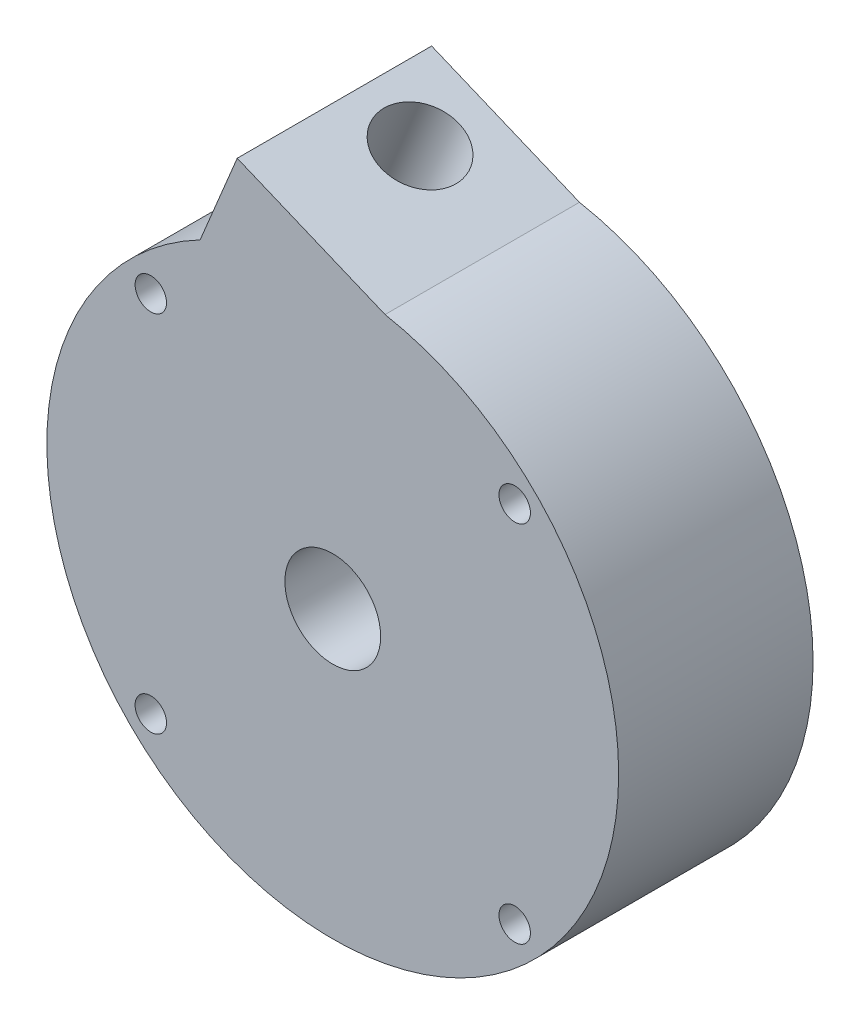
ISO-10303-21;
HEADER;
FILE_DESCRIPTION(('STEP AP214'),'2;1');
FILE_NAME('part.step','',(''),(''),'','','');
FILE_SCHEMA(('AUTOMOTIVE_DESIGN { 1 0 10303 214 1 1 1 1 }'));
ENDSEC;
DATA;
#1=APPLICATION_CONTEXT('core data for automotive mechanical design processes');
#2=APPLICATION_PROTOCOL_DEFINITION('international standard','automotive_design',2000,#1);
#3=PRODUCT_CONTEXT('',#1,'mechanical');
#4=PRODUCT('Part','Part','',(#3));
#5=PRODUCT_RELATED_PRODUCT_CATEGORY('part','',(#4));
#6=PRODUCT_DEFINITION_FORMATION('','',#4);
#7=PRODUCT_DEFINITION_CONTEXT('part definition',#1,'design');
#8=PRODUCT_DEFINITION('design','',#6,#7);
#9=PRODUCT_DEFINITION_SHAPE('','',#8);
#10=(LENGTH_UNIT() NAMED_UNIT(*) SI_UNIT(.MILLI.,.METRE.));
#11=(NAMED_UNIT(*) PLANE_ANGLE_UNIT() SI_UNIT($,.RADIAN.));
#12=(NAMED_UNIT(*) SI_UNIT($,.STERADIAN.) SOLID_ANGLE_UNIT());
#13=UNCERTAINTY_MEASURE_WITH_UNIT(LENGTH_MEASURE(1.E-05),#10,'distance_accuracy_value','');
#14=(GEOMETRIC_REPRESENTATION_CONTEXT(3) GLOBAL_UNCERTAINTY_ASSIGNED_CONTEXT((#13)) GLOBAL_UNIT_ASSIGNED_CONTEXT((#10,
#11,#12)) REPRESENTATION_CONTEXT('',''));
#15=CARTESIAN_POINT('',(0.,0.,0.));
#16=DIRECTION('',(0.,0.,1.));
#17=DIRECTION('',(1.,0.,0.));
#18=AXIS2_PLACEMENT_3D('',#15,#16,#17);
#19=CARTESIAN_POINT('',(0.,0.,34.));
#20=DIRECTION('',(0.,0.,1.));
#21=DIRECTION('',(1.,0.,0.));
#22=AXIS2_PLACEMENT_3D('',#19,#20,#21);
#23=PLANE('',#22);
#24=CARTESIAN_POINT('',(0.,0.,34.));
#25=DIRECTION('',(0.,0.,1.));
#26=DIRECTION('',(1.,0.,0.));
#27=AXIS2_PLACEMENT_3D('',#24,#25,#26);
#28=CIRCLE('',#27,8.37499999999999);
#29=CARTESIAN_POINT('',(8.37499999999999,0.,34.));
#30=VERTEX_POINT('',#29);
#31=EDGE_CURVE('E320',#30,#30,#28,.T.);
#32=ORIENTED_EDGE('',*,*,#31,.F.);
#33=EDGE_LOOP('',(#32));
#34=FACE_BOUND('',#33,.T.);
#35=CARTESIAN_POINT('',(0.,0.,34.));
#36=DIRECTION('',(0.,0.,1.));
#37=DIRECTION('',(1.,0.,0.));
#38=AXIS2_PLACEMENT_3D('',#35,#36,#37);
#39=CIRCLE('',#38,50.);
#40=CARTESIAN_POINT('',(-23.1916722818952,44.2961210126708,34.));
#41=VERTEX_POINT('',#40);
#42=CARTESIAN_POINT('',(9.14885542392408,49.1558586989602,34.));
#43=VERTEX_POINT('',#42);
#44=EDGE_CURVE('E12',#41,#43,#39,.T.);
#45=ORIENTED_EDGE('',*,*,#44,.T.);
#46=DIRECTION('',(-0.923448007913106,0.383723568055595,0.));
#47=VECTOR('',#46,1.);
#48=CARTESIAN_POINT('',(57.7939064023322,28.9422111847218,34.));
#49=LINE('',#48,#47);
#50=CARTESIAN_POINT('',(-16.707688797643,59.9001186045169,34.));
#51=VERTEX_POINT('',#50);
#52=EDGE_CURVE('E115',#43,#51,#49,.T.);
#53=ORIENTED_EDGE('',*,*,#52,.T.);
#54=DIRECTION('',(0.383723568055596,0.923448007913105,0.));
#55=VECTOR('',#54,1.);
#56=CARTESIAN_POINT('',(-74.5015951999753,-79.1835139364422,34.));
#57=LINE('',#56,#55);
#58=EDGE_CURVE('E65',#41,#51,#57,.T.);
#59=ORIENTED_EDGE('',*,*,#58,.F.);
#60=EDGE_LOOP('',(#45,#53,#59));
#61=FACE_BOUND('',#60,.T.);
#62=CARTESIAN_POINT('',(31.8198051533946,-31.8198051533946,34.));
#63=DIRECTION('',(0.,0.,1.));
#64=DIRECTION('',(1.,0.,0.));
#65=AXIS2_PLACEMENT_3D('',#62,#63,#64);
#66=CIRCLE('',#65,2.74999999999999);
#67=CARTESIAN_POINT('',(34.5698051533946,-31.8198051533946,34.));
#68=VERTEX_POINT('',#67);
#69=EDGE_CURVE('E139',#68,#68,#66,.T.);
#70=ORIENTED_EDGE('',*,*,#69,.F.);
#71=EDGE_LOOP('',(#70));
#72=FACE_BOUND('',#71,.T.);
#73=CARTESIAN_POINT('',(-31.8198051533946,31.8198051533946,34.));
#74=DIRECTION('',(0.,0.,1.));
#75=DIRECTION('',(1.,0.,0.));
#76=AXIS2_PLACEMENT_3D('',#73,#74,#75);
#77=CIRCLE('',#76,2.74999999999999);
#78=CARTESIAN_POINT('',(-29.0698051533946,31.8198051533946,34.));
#79=VERTEX_POINT('',#78);
#80=EDGE_CURVE('E143',#79,#79,#77,.T.);
#81=ORIENTED_EDGE('',*,*,#80,.F.);
#82=EDGE_LOOP('',(#81));
#83=FACE_BOUND('',#82,.T.);
#84=CARTESIAN_POINT('',(-31.8198051533946,-31.8198051533946,34.));
#85=DIRECTION('',(0.,0.,1.));
#86=DIRECTION('',(1.,0.,0.));
#87=AXIS2_PLACEMENT_3D('',#84,#85,#86);
#88=CIRCLE('',#87,2.74999999999999);
#89=CARTESIAN_POINT('',(-29.0698051533946,-31.8198051533946,34.));
#90=VERTEX_POINT('',#89);
#91=EDGE_CURVE('E147',#90,#90,#88,.T.);
#92=ORIENTED_EDGE('',*,*,#91,.F.);
#93=EDGE_LOOP('',(#92));
#94=FACE_BOUND('',#93,.T.);
#95=CARTESIAN_POINT('',(31.8198051533946,31.8198051533946,34.));
#96=DIRECTION('',(0.,0.,1.));
#97=DIRECTION('',(1.,0.,0.));
#98=AXIS2_PLACEMENT_3D('',#95,#96,#97);
#99=CIRCLE('',#98,2.74999999999999);
#100=CARTESIAN_POINT('',(34.5698051533946,31.8198051533946,34.));
#101=VERTEX_POINT('',#100);
#102=EDGE_CURVE('E150',#101,#101,#99,.T.);
#103=ORIENTED_EDGE('',*,*,#102,.F.);
#104=EDGE_LOOP('',(#103));
#105=FACE_BOUND('',#104,.T.);
#106=ADVANCED_FACE('F50',(#34,#61,#72,#83,#94,#105),#23,.T.);
#107=CARTESIAN_POINT('',(0.,0.,0.));
#108=DIRECTION('',(0.,0.,1.));
#109=DIRECTION('',(1.,0.,0.));
#110=AXIS2_PLACEMENT_3D('',#107,#108,#109);
#111=PLANE('',#110);
#112=DIRECTION('',(0.923448007913106,-0.383723568055595,0.));
#113=VECTOR('',#112,1.);
#114=CARTESIAN_POINT('',(51.3099229180801,13.3382135928758,0.));
#115=LINE('',#114,#113);
#116=CARTESIAN_POINT('',(-20.4213282581558,43.144950308504,0.));
#117=VERTEX_POINT('',#116);
#118=CARTESIAN_POINT('',(-6.01553933471138,37.1588626468367,0.));
#119=VERTEX_POINT('',#118);
#120=EDGE_CURVE('E339',#117,#119,#115,.T.);
#121=ORIENTED_EDGE('',*,*,#120,.F.);
#122=DIRECTION('',(0.383723568055596,0.923448007913105,0.));
#123=VECTOR('',#122,1.);
#124=CARTESIAN_POINT('',(-71.7312511762359,-80.334684640609,0.));
#125=LINE('',#124,#123);
#126=CARTESIAN_POINT('',(-27.2378809360153,26.7406100093122,0.));
#127=VERTEX_POINT('',#126);
#128=EDGE_CURVE('E342',#127,#117,#125,.T.);
#129=ORIENTED_EDGE('',*,*,#128,.F.);
#130=CARTESIAN_POINT('',(-54.9413211734085,38.25231705098,0.));
#131=DIRECTION('',(0.,0.,1.));
#132=DIRECTION('',(1.,0.,0.));
#133=AXIS2_PLACEMENT_3D('',#130,#131,#132);
#134=CIRCLE('',#133,30.);
#135=CARTESIAN_POINT('',(-30.1189720521702,21.4044393180619,0.));
#136=VERTEX_POINT('',#135);
#137=EDGE_CURVE('E345',#136,#127,#134,.T.);
#138=ORIENTED_EDGE('',*,*,#137,.F.);
#139=CARTESIAN_POINT('',(-8.41161896583205,31.3925893543947,0.));
#140=CARTESIAN_POINT('',(-6.59498655692887,31.9273439059173,0.));
#141=CARTESIAN_POINT('',(-4.72759665589687,32.3040116625754,0.));
#142=CARTESIAN_POINT('',(-0.947579393855885,32.7269500427533,0.));
#143=CARTESIAN_POINT('',(0.964989800608965,32.7732083727551,0.));
#144=CARTESIAN_POINT('',(4.77710877725085,32.5310810574549,0.));
#145=CARTESIAN_POINT('',(6.6765988909068,32.2426934409023,0.));
#146=CARTESIAN_POINT('',(10.4042078217419,31.337263885961,0.));
#147=CARTESIAN_POINT('',(12.2322672936029,30.7202304457304,0.));
#148=CARTESIAN_POINT('',(15.760360447992,29.173637757705,0.));
#149=CARTESIAN_POINT('',(17.4603369387661,28.2440973030589,0.));
#150=CARTESIAN_POINT('',(20.6790622470469,26.098347596263,0.));
#151=CARTESIAN_POINT('',(22.1977578054618,24.8821669390156,0.));
#152=CARTESIAN_POINT('',(25.0058356427531,22.198009272827,0.));
#153=CARTESIAN_POINT('',(26.2951702677157,20.7300698610981,0.));
#154=CARTESIAN_POINT('',(28.6030770399887,17.5852862615814,0.));
#155=CARTESIAN_POINT('',(29.621608652021,15.9084875898363,0.));
#156=CARTESIAN_POINT('',(31.3544252087226,12.3956449637935,0.));
#157=CARTESIAN_POINT('',(32.0686780431636,10.5596531079759,0.));
#158=CARTESIAN_POINT('',(33.1685124520496,6.78338183568033,0.));
#159=CARTESIAN_POINT('',(33.554071398709,4.84315954999618,0.));
#160=CARTESIAN_POINT('',(33.9819779982146,0.9170386600299,0.));
#161=CARTESIAN_POINT('',(34.0243132794646,-1.06879949890293,0.));
#162=CARTESIAN_POINT('',(33.7616448126502,-5.02565789488448,0.));
#163=CARTESIAN_POINT('',(33.4566394131377,-6.99661620578227,0.));
#164=CARTESIAN_POINT('',(32.5057860053459,-10.8631805220921,0.));
#165=CARTESIAN_POINT('',(31.8599472031514,-12.7587250146704,0.));
#166=CARTESIAN_POINT('',(30.2444344658908,-16.4157462169828,0.));
#167=CARTESIAN_POINT('',(29.274780398416,-18.1771637237506,0.));
#168=CARTESIAN_POINT('',(27.0387184652918,-21.5108525379583,0.));
#169=CARTESIAN_POINT('',(25.772340602703,-23.0830687928153,0.));
#170=CARTESIAN_POINT('',(22.9792358346881,-25.9886347223964,0.));
#171=CARTESIAN_POINT('',(21.4525482253563,-27.3219352222074,0.));
#172=CARTESIAN_POINT('',(18.1835090503277,-29.7068773521282,0.));
#173=CARTESIAN_POINT('',(16.4412049384089,-30.7584772449035,0.));
#174=CARTESIAN_POINT('',(12.7925922031796,-32.5455235820591,0.));
#175=CARTESIAN_POINT('',(10.8863377957731,-33.2809370698108,0.));
#176=CARTESIAN_POINT('',(6.96692751775982,-34.4105391787325,0.));
#177=CARTESIAN_POINT('',(4.95383101040614,-34.8047047072262,0.));
#178=CARTESIAN_POINT('',(0.881572969327515,-35.2370073616113,0.));
#179=CARTESIAN_POINT('',(-1.17752583972078,-35.2751320467303,0.));
#180=CARTESIAN_POINT('',(-5.27905712721527,-34.9913531552568,0.));
#181=CARTESIAN_POINT('',(-7.3214254229152,-34.669448255876,0.));
#182=CARTESIAN_POINT('',(-11.3267805742622,-33.6726219752596,0.));
#183=CARTESIAN_POINT('',(-13.2897037521198,-32.9977105165779,0.));
#184=CARTESIAN_POINT('',(-17.0753954472404,-31.3127657075608,0.));
#185=CARTESIAN_POINT('',(-18.898102754332,-30.3027533072263,0.));
#186=CARTESIAN_POINT('',(-22.3464123691171,-27.9759197387277,0.));
#187=CARTESIAN_POINT('',(-23.9719578360684,-26.6591299889305,0.));
#188=CARTESIAN_POINT('',(-26.9745944537781,-23.7566853350126,0.));
#189=CARTESIAN_POINT('',(-28.3516349151178,-22.1710714319796,0.));
#190=CARTESIAN_POINT('',(-30.8131330293807,-18.7774625019632,0.));
#191=CARTESIAN_POINT('',(-31.897547750371,-16.9695168713819,0.));
#192=CARTESIAN_POINT('',(-33.7382971452239,-13.1849080344906,0.));
#193=CARTESIAN_POINT('',(-34.4945980242525,-11.2083011650251,0.));
#194=CARTESIAN_POINT('',(-35.653409824858,-7.14562096872495,0.));
#195=CARTESIAN_POINT('',(-36.0558971975498,-5.05960923964018,0.));
#196=CARTESIAN_POINT('',(-36.492023630975,-0.841182207962756,0.));
#197=CARTESIAN_POINT('',(-36.5256501906637,1.2911680901299,0.));
#198=CARTESIAN_POINT('',(-36.2201917845468,5.5373040638973,0.));
#199=CARTESIAN_POINT('',(-35.8811058334673,7.65102330129104,0.));
#200=CARTESIAN_POINT('',(-34.8377581321816,11.7950031172486,0.));
#201=CARTESIAN_POINT('',(-34.1335070295338,13.8251978556522,0.));
#202=CARTESIAN_POINT('',(-32.3786188729451,17.739300975288,0.));
#203=CARTESIAN_POINT('',(-31.32800385937,19.6231461431737,0.));
#204=CARTESIAN_POINT('',(-30.1189720521702,21.4044393180619,0.));
#205=B_SPLINE_CURVE_WITH_KNOTS('',3,(#139,#140,#141,#142,#143,#144,#145,#146,#147,#148,#149,
#150,#151,#152,#153,#154,#155,#156,#157,#158,#159,#160,#161,#162,#163,#164,#165,#166,#167,#168,
#169,#170,#171,#172,#173,#174,#175,#176,#177,#178,#179,#180,#181,#182,#183,#184,#185,#186,#187,
#188,#189,#190,#191,#192,#193,#194,#195,#196,#197,#198,#199,#200,#201,#202,#203,#204),
.UNSPECIFIED.,.F.,.F.,(4,2,2,2,2,2,2,2,2,2,2,2,2,2,2,2,2,2,2,2,2,2,2,2,2,2,2,2,2,2,2,2,4),(0.,
0.03125,0.0625,0.09375,0.125,0.15625,0.1875,0.21875,0.25,0.28125,0.3125,0.34375,0.375,0.40625,
0.4375,0.46875,0.5,0.53125,0.5625,0.59375,0.625,0.65625,0.6875,0.71875,0.75,0.78125,0.8125,
0.84375,0.875,0.90625,0.9375,0.96875,1.),.UNSPECIFIED.);
#206=CARTESIAN_POINT('',(-8.41161896583204,31.3925893543947,0.));
#207=VERTEX_POINT('',#206);
#208=EDGE_CURVE('E73',#207,#136,#205,.T.);
#209=ORIENTED_EDGE('',*,*,#208,.F.);
#210=DIRECTION('',(0.383723568055595,0.923448007913106,0.));
#211=VECTOR('',#210,1.);
#212=CARTESIAN_POINT('',(-57.3254622527914,-86.3207723022763,0.));
#213=LINE('',#212,#211);
#214=EDGE_CURVE('E333',#207,#119,#213,.T.);
#215=ORIENTED_EDGE('',*,*,#214,.T.);
#216=EDGE_LOOP('',(#121,#129,#138,#209,#215));
#217=FACE_BOUND('',#216,.T.);
#218=CARTESIAN_POINT('',(31.8198051533946,-31.8198051533946,0.));
#219=DIRECTION('',(0.,0.,1.));
#220=DIRECTION('',(1.,0.,0.));
#221=AXIS2_PLACEMENT_3D('',#218,#219,#220);
#222=CIRCLE('',#221,2.74999999999999);
#223=CARTESIAN_POINT('',(34.5698051533946,-31.8198051533946,0.));
#224=VERTEX_POINT('',#223);
#225=EDGE_CURVE('E152',#224,#224,#222,.T.);
#226=ORIENTED_EDGE('',*,*,#225,.T.);
#227=EDGE_LOOP('',(#226));
#228=FACE_BOUND('',#227,.T.);
#229=CARTESIAN_POINT('',(-31.8198051533946,31.8198051533946,0.));
#230=DIRECTION('',(0.,0.,1.));
#231=DIRECTION('',(1.,0.,0.));
#232=AXIS2_PLACEMENT_3D('',#229,#230,#231);
#233=CIRCLE('',#232,2.74999999999999);
#234=CARTESIAN_POINT('',(-29.0698051533946,31.8198051533946,0.));
#235=VERTEX_POINT('',#234);
#236=EDGE_CURVE('E167',#235,#235,#233,.T.);
#237=ORIENTED_EDGE('',*,*,#236,.T.);
#238=EDGE_LOOP('',(#237));
#239=FACE_BOUND('',#238,.T.);
#240=CARTESIAN_POINT('',(0.,0.,0.));
#241=DIRECTION('',(0.,0.,1.));
#242=DIRECTION('',(1.,0.,0.));
#243=AXIS2_PLACEMENT_3D('',#240,#241,#242);
#244=CIRCLE('',#243,50.);
#245=CARTESIAN_POINT('',(-23.1916722818952,44.2961210126708,0.));
#246=VERTEX_POINT('',#245);
#247=CARTESIAN_POINT('',(9.14885542392408,49.1558586989602,0.));
#248=VERTEX_POINT('',#247);
#249=EDGE_CURVE('E59',#246,#248,#244,.T.);
#250=ORIENTED_EDGE('',*,*,#249,.F.);
#251=DIRECTION('',(0.383723568055596,0.923448007913106,0.));
#252=VECTOR('',#251,1.);
#253=CARTESIAN_POINT('',(-74.5015951999753,-79.1835139364422,0.));
#254=LINE('',#253,#252);
#255=CARTESIAN_POINT('',(-16.707688797643,59.9001186045169,0.));
#256=VERTEX_POINT('',#255);
#257=EDGE_CURVE('E122',#246,#256,#254,.T.);
#258=ORIENTED_EDGE('',*,*,#257,.T.);
#259=DIRECTION('',(-0.923448007913106,0.383723568055595,0.));
#260=VECTOR('',#259,1.);
#261=CARTESIAN_POINT('',(57.7939064023322,28.9422111847218,0.));
#262=LINE('',#261,#260);
#263=EDGE_CURVE('E129',#248,#256,#262,.T.);
#264=ORIENTED_EDGE('',*,*,#263,.F.);
#265=EDGE_LOOP('',(#250,#258,#264));
#266=FACE_BOUND('',#265,.T.);
#267=CARTESIAN_POINT('',(-31.8198051533946,-31.8198051533946,0.));
#268=DIRECTION('',(0.,0.,1.));
#269=DIRECTION('',(1.,0.,0.));
#270=AXIS2_PLACEMENT_3D('',#267,#268,#269);
#271=CIRCLE('',#270,2.74999999999999);
#272=CARTESIAN_POINT('',(-29.0698051533946,-31.8198051533946,0.));
#273=VERTEX_POINT('',#272);
#274=EDGE_CURVE('E163',#273,#273,#271,.T.);
#275=ORIENTED_EDGE('',*,*,#274,.T.);
#276=EDGE_LOOP('',(#275));
#277=FACE_BOUND('',#276,.T.);
#278=CARTESIAN_POINT('',(31.8198051533946,31.8198051533946,0.));
#279=DIRECTION('',(0.,0.,1.));
#280=DIRECTION('',(1.,0.,0.));
#281=AXIS2_PLACEMENT_3D('',#278,#279,#280);
#282=CIRCLE('',#281,2.74999999999999);
#283=CARTESIAN_POINT('',(34.5698051533946,31.8198051533946,0.));
#284=VERTEX_POINT('',#283);
#285=EDGE_CURVE('E153',#284,#284,#282,.T.);
#286=ORIENTED_EDGE('',*,*,#285,.T.);
#287=EDGE_LOOP('',(#286));
#288=FACE_BOUND('',#287,.T.);
#289=ADVANCED_FACE('F134',(#217,#228,#239,#266,#277,#288),#111,.F.);
#290=CARTESIAN_POINT('',(0.,0.,34.));
#291=DIRECTION('',(0.,0.,-1.));
#292=DIRECTION('',(-1.,0.,0.));
#293=AXIS2_PLACEMENT_3D('',#290,#291,#292);
#294=CYLINDRICAL_SURFACE('',#293,50.);
#295=ORIENTED_EDGE('',*,*,#44,.F.);
#296=DIRECTION('',(0.,0.,-1.));
#297=VECTOR('',#296,1.);
#298=CARTESIAN_POINT('',(-23.1916722818952,44.2961210126708,73.5357364269794));
#299=LINE('',#298,#297);
#300=EDGE_CURVE('E130',#41,#246,#299,.T.);
#301=ORIENTED_EDGE('',*,*,#300,.T.);
#302=ORIENTED_EDGE('',*,*,#249,.T.);
#303=DIRECTION('',(0.,0.,-1.));
#304=VECTOR('',#303,1.);
#305=CARTESIAN_POINT('',(9.14885542392408,49.1558586989602,73.5357364269794));
#306=LINE('',#305,#304);
#307=EDGE_CURVE('E119',#43,#248,#306,.T.);
#308=ORIENTED_EDGE('',*,*,#307,.F.);
#309=EDGE_LOOP('',(#295,#301,#302,#308));
#310=FACE_BOUND('',#309,.T.);
#311=ADVANCED_FACE('F52',(#310),#294,.T.);
#312=CARTESIAN_POINT('',(-31.8198051533946,31.8198051533946,34.));
#313=DIRECTION('',(0.,0.,-1.));
#314=DIRECTION('',(-1.,0.,0.));
#315=AXIS2_PLACEMENT_3D('',#312,#313,#314);
#316=CYLINDRICAL_SURFACE('',#315,2.74999999999999);
#317=ORIENTED_EDGE('',*,*,#80,.T.);
#318=EDGE_LOOP('',(#317));
#319=FACE_BOUND('',#318,.T.);
#320=ORIENTED_EDGE('',*,*,#236,.F.);
#321=EDGE_LOOP('',(#320));
#322=FACE_BOUND('',#321,.T.);
#323=ADVANCED_FACE('F172',(#319,#322),#316,.F.);
#324=CARTESIAN_POINT('',(-31.8198051533946,-31.8198051533946,34.));
#325=DIRECTION('',(0.,0.,-1.));
#326=DIRECTION('',(-1.,0.,0.));
#327=AXIS2_PLACEMENT_3D('',#324,#325,#326);
#328=CYLINDRICAL_SURFACE('',#327,2.74999999999999);
#329=ORIENTED_EDGE('',*,*,#91,.T.);
#330=EDGE_LOOP('',(#329));
#331=FACE_BOUND('',#330,.T.);
#332=ORIENTED_EDGE('',*,*,#274,.F.);
#333=EDGE_LOOP('',(#332));
#334=FACE_BOUND('',#333,.T.);
#335=ADVANCED_FACE('F175',(#331,#334),#328,.F.);
#336=CARTESIAN_POINT('',(31.8198051533946,-31.8198051533946,34.));
#337=DIRECTION('',(0.,0.,-1.));
#338=DIRECTION('',(-1.,0.,0.));
#339=AXIS2_PLACEMENT_3D('',#336,#337,#338);
#340=CYLINDRICAL_SURFACE('',#339,2.74999999999999);
#341=ORIENTED_EDGE('',*,*,#69,.T.);
#342=EDGE_LOOP('',(#341));
#343=FACE_BOUND('',#342,.T.);
#344=ORIENTED_EDGE('',*,*,#225,.F.);
#345=EDGE_LOOP('',(#344));
#346=FACE_BOUND('',#345,.T.);
#347=ADVANCED_FACE('F192',(#343,#346),#340,.F.);
#348=CARTESIAN_POINT('',(31.8198051533946,31.8198051533946,34.));
#349=DIRECTION('',(0.,0.,-1.));
#350=DIRECTION('',(-1.,0.,0.));
#351=AXIS2_PLACEMENT_3D('',#348,#349,#350);
#352=CYLINDRICAL_SURFACE('',#351,2.74999999999999);
#353=ORIENTED_EDGE('',*,*,#102,.T.);
#354=EDGE_LOOP('',(#353));
#355=FACE_BOUND('',#354,.T.);
#356=ORIENTED_EDGE('',*,*,#285,.F.);
#357=EDGE_LOOP('',(#356));
#358=FACE_BOUND('',#357,.T.);
#359=ADVANCED_FACE('F189',(#355,#358),#352,.F.);
#360=CARTESIAN_POINT('',(-8.41161896583205,31.3925893543947,20.));
#361=CARTESIAN_POINT('',(-6.59498655692887,31.9273439059173,20.));
#362=CARTESIAN_POINT('',(-4.72759665589687,32.3040116625754,20.));
#363=CARTESIAN_POINT('',(-0.947579393855885,32.7269500427533,20.));
#364=CARTESIAN_POINT('',(0.964989800608965,32.7732083727551,20.));
#365=CARTESIAN_POINT('',(4.77710877725085,32.5310810574549,20.));
#366=CARTESIAN_POINT('',(6.6765988909068,32.2426934409023,20.));
#367=CARTESIAN_POINT('',(10.4042078217419,31.337263885961,20.));
#368=CARTESIAN_POINT('',(12.2322672936029,30.7202304457304,20.));
#369=CARTESIAN_POINT('',(15.760360447992,29.173637757705,20.));
#370=CARTESIAN_POINT('',(17.4603369387661,28.2440973030589,20.));
#371=CARTESIAN_POINT('',(20.6790622470469,26.098347596263,20.));
#372=CARTESIAN_POINT('',(22.1977578054618,24.8821669390156,20.));
#373=CARTESIAN_POINT('',(25.0058356427531,22.198009272827,20.));
#374=CARTESIAN_POINT('',(26.2951702677157,20.7300698610981,20.));
#375=CARTESIAN_POINT('',(28.6030770399887,17.5852862615814,20.));
#376=CARTESIAN_POINT('',(29.621608652021,15.9084875898363,20.));
#377=CARTESIAN_POINT('',(31.3544252087226,12.3956449637935,20.));
#378=CARTESIAN_POINT('',(32.0686780431636,10.5596531079759,20.));
#379=CARTESIAN_POINT('',(33.1685124520496,6.78338183568033,20.));
#380=CARTESIAN_POINT('',(33.554071398709,4.84315954999618,20.));
#381=CARTESIAN_POINT('',(33.9819779982146,0.9170386600299,20.));
#382=CARTESIAN_POINT('',(34.0243132794646,-1.06879949890293,20.));
#383=CARTESIAN_POINT('',(33.7616448126502,-5.02565789488448,20.));
#384=CARTESIAN_POINT('',(33.4566394131377,-6.99661620578227,20.));
#385=CARTESIAN_POINT('',(32.5057860053459,-10.8631805220921,20.));
#386=CARTESIAN_POINT('',(31.8599472031514,-12.7587250146704,20.));
#387=CARTESIAN_POINT('',(30.2444344658908,-16.4157462169828,20.));
#388=CARTESIAN_POINT('',(29.274780398416,-18.1771637237506,20.));
#389=CARTESIAN_POINT('',(27.0387184652918,-21.5108525379583,20.));
#390=CARTESIAN_POINT('',(25.772340602703,-23.0830687928153,20.));
#391=CARTESIAN_POINT('',(22.9792358346881,-25.9886347223964,20.));
#392=CARTESIAN_POINT('',(21.4525482253563,-27.3219352222074,20.));
#393=CARTESIAN_POINT('',(18.1835090503277,-29.7068773521282,20.));
#394=CARTESIAN_POINT('',(16.4412049384089,-30.7584772449035,20.));
#395=CARTESIAN_POINT('',(12.7925922031796,-32.5455235820591,20.));
#396=CARTESIAN_POINT('',(10.8863377957731,-33.2809370698108,20.));
#397=CARTESIAN_POINT('',(6.96692751775982,-34.4105391787325,20.));
#398=CARTESIAN_POINT('',(4.95383101040614,-34.8047047072262,20.));
#399=CARTESIAN_POINT('',(0.881572969327515,-35.2370073616113,20.));
#400=CARTESIAN_POINT('',(-1.17752583972078,-35.2751320467303,20.));
#401=CARTESIAN_POINT('',(-5.27905712721527,-34.9913531552568,20.));
#402=CARTESIAN_POINT('',(-7.3214254229152,-34.669448255876,20.));
#403=CARTESIAN_POINT('',(-11.3267805742622,-33.6726219752596,20.));
#404=CARTESIAN_POINT('',(-13.2897037521198,-32.9977105165779,20.));
#405=CARTESIAN_POINT('',(-17.0753954472404,-31.3127657075608,20.));
#406=CARTESIAN_POINT('',(-18.898102754332,-30.3027533072263,20.));
#407=CARTESIAN_POINT('',(-22.3464123691171,-27.9759197387277,20.));
#408=CARTESIAN_POINT('',(-23.9719578360684,-26.6591299889305,20.));
#409=CARTESIAN_POINT('',(-26.9745944537781,-23.7566853350126,20.));
#410=CARTESIAN_POINT('',(-28.3516349151178,-22.1710714319796,20.));
#411=CARTESIAN_POINT('',(-30.8131330293807,-18.7774625019632,20.));
#412=CARTESIAN_POINT('',(-31.897547750371,-16.9695168713819,20.));
#413=CARTESIAN_POINT('',(-33.7382971452239,-13.1849080344906,20.));
#414=CARTESIAN_POINT('',(-34.4945980242525,-11.2083011650251,20.));
#415=CARTESIAN_POINT('',(-35.653409824858,-7.14562096872495,20.));
#416=CARTESIAN_POINT('',(-36.0558971975498,-5.05960923964018,20.));
#417=CARTESIAN_POINT('',(-36.492023630975,-0.841182207962756,20.));
#418=CARTESIAN_POINT('',(-36.5256501906637,1.2911680901299,20.));
#419=CARTESIAN_POINT('',(-36.2201917845468,5.5373040638973,20.));
#420=CARTESIAN_POINT('',(-35.8811058334673,7.65102330129104,20.));
#421=CARTESIAN_POINT('',(-34.8377581321816,11.7950031172486,20.));
#422=CARTESIAN_POINT('',(-34.1335070295338,13.8251978556522,20.));
#423=CARTESIAN_POINT('',(-32.3786188729451,17.739300975288,20.));
#424=CARTESIAN_POINT('',(-31.32800385937,19.6231461431737,20.));
#425=CARTESIAN_POINT('',(-30.1189720521702,21.4044393180619,20.));
#426=B_SPLINE_CURVE_WITH_KNOTS('',3,(#360,#361,#362,#363,#364,#365,#366,#367,#368,#369,#370,
#371,#372,#373,#374,#375,#376,#377,#378,#379,#380,#381,#382,#383,#384,#385,#386,#387,#388,#389,
#390,#391,#392,#393,#394,#395,#396,#397,#398,#399,#400,#401,#402,#403,#404,#405,#406,#407,#408,
#409,#410,#411,#412,#413,#414,#415,#416,#417,#418,#419,#420,#421,#422,#423,#424,#425),
.UNSPECIFIED.,.F.,.F.,(4,2,2,2,2,2,2,2,2,2,2,2,2,2,2,2,2,2,2,2,2,2,2,2,2,2,2,2,2,2,2,2,4),(0.,
0.03125,0.0625,0.09375,0.125,0.15625,0.1875,0.21875,0.25,0.28125,0.3125,0.34375,0.375,0.40625,
0.4375,0.46875,0.5,0.53125,0.5625,0.59375,0.625,0.65625,0.6875,0.71875,0.75,0.78125,0.8125,
0.84375,0.875,0.90625,0.9375,0.96875,1.),.UNSPECIFIED.);
#427=DIRECTION('',(0.,0.,-1.));
#428=VECTOR('',#427,1.);
#429=SURFACE_OF_LINEAR_EXTRUSION('',#426,#428);
#430=ORIENTED_EDGE('',*,*,#208,.T.);
#431=DIRECTION('',(0.,0.,-1.));
#432=VECTOR('',#431,1.);
#433=CARTESIAN_POINT('',(-30.1189720521702,21.4044393180619,20.));
#434=LINE('',#433,#432);
#435=CARTESIAN_POINT('',(-30.1189720521702,21.4044393180619,20.));
#436=VERTEX_POINT('',#435);
#437=EDGE_CURVE('E367',#436,#136,#434,.T.);
#438=ORIENTED_EDGE('',*,*,#437,.F.);
#439=CARTESIAN_POINT('',(-8.41161896583204,31.3925893543947,20.));
#440=VERTEX_POINT('',#439);
#441=EDGE_CURVE('E347',#440,#436,#426,.T.);
#442=ORIENTED_EDGE('',*,*,#441,.F.);
#443=DIRECTION('',(0.,0.,-1.));
#444=VECTOR('',#443,1.);
#445=CARTESIAN_POINT('',(-8.41161896583204,31.3925893543947,20.));
#446=LINE('',#445,#444);
#447=EDGE_CURVE('E158',#440,#207,#446,.T.);
#448=ORIENTED_EDGE('',*,*,#447,.T.);
#449=EDGE_LOOP('',(#430,#438,#442,#448));
#450=FACE_BOUND('',#449,.T.);
#451=ADVANCED_FACE('F191',(#450),#429,.F.);
#452=CARTESIAN_POINT('',(-57.3254622527914,-86.3207723022763,20.));
#453=DIRECTION('',(-0.923448007913106,0.383723568055595,0.));
#454=DIRECTION('',(-0.383723568055595,-0.923448007913105,0.));
#455=AXIS2_PLACEMENT_3D('',#452,#453,#454);
#456=PLANE('',#455);
#457=ORIENTED_EDGE('',*,*,#214,.F.);
#458=ORIENTED_EDGE('',*,*,#447,.F.);
#459=DIRECTION('',(0.383723568055595,0.923448007913106,0.));
#460=VECTOR('',#459,1.);
#461=CARTESIAN_POINT('',(-57.3254622527914,-86.3207723022763,20.));
#462=LINE('',#461,#460);
#463=CARTESIAN_POINT('',(-6.01553933471138,37.1588626468367,20.));
#464=VERTEX_POINT('',#463);
#465=EDGE_CURVE('E353',#440,#464,#462,.T.);
#466=ORIENTED_EDGE('',*,*,#465,.T.);
#467=DIRECTION('',(0.,0.,-1.));
#468=VECTOR('',#467,1.);
#469=CARTESIAN_POINT('',(-6.01553933471138,37.1588626468367,20.));
#470=LINE('',#469,#468);
#471=EDGE_CURVE('E373',#464,#119,#470,.T.);
#472=ORIENTED_EDGE('',*,*,#471,.T.);
#473=EDGE_LOOP('',(#457,#458,#466,#472));
#474=FACE_BOUND('',#473,.T.);
#475=ADVANCED_FACE('F198',(#474),#456,.T.);
#476=CARTESIAN_POINT('',(51.3099229180801,13.3382135928758,20.));
#477=DIRECTION('',(0.383723568055595,0.923448007913106,0.));
#478=DIRECTION('',(-0.923448007913106,0.383723568055595,0.));
#479=AXIS2_PLACEMENT_3D('',#476,#477,#478);
#480=PLANE('',#479);
#481=CARTESIAN_POINT('',(-13.2184337964336,40.1519064776704,12.));
#482=DIRECTION('',(0.383723568055595,0.923448007913106,0.));
#483=DIRECTION('',(-0.923448007913106,0.383723568055595,0.));
#484=AXIS2_PLACEMENT_3D('',#481,#482,#483);
#485=CIRCLE('',#484,6.8);
#486=CARTESIAN_POINT('',(-19.4978802502427,42.7612267404484,12.));
#487=VERTEX_POINT('',#486);
#488=EDGE_CURVE('E318',#487,#487,#485,.F.);
#489=ORIENTED_EDGE('',*,*,#488,.F.);
#490=EDGE_LOOP('',(#489));
#491=FACE_BOUND('',#490,.T.);
#492=ORIENTED_EDGE('',*,*,#120,.T.);
#493=ORIENTED_EDGE('',*,*,#471,.F.);
#494=DIRECTION('',(0.923448007913106,-0.383723568055595,0.));
#495=VECTOR('',#494,1.);
#496=CARTESIAN_POINT('',(51.3099229180801,13.3382135928758,20.));
#497=LINE('',#496,#495);
#498=CARTESIAN_POINT('',(-20.4213282581558,43.144950308504,20.));
#499=VERTEX_POINT('',#498);
#500=EDGE_CURVE('E358',#499,#464,#497,.T.);
#501=ORIENTED_EDGE('',*,*,#500,.F.);
#502=DIRECTION('',(0.,0.,-1.));
#503=VECTOR('',#502,1.);
#504=CARTESIAN_POINT('',(-20.4213282581558,43.144950308504,20.));
#505=LINE('',#504,#503);
#506=EDGE_CURVE('E371',#499,#117,#505,.T.);
#507=ORIENTED_EDGE('',*,*,#506,.T.);
#508=EDGE_LOOP('',(#492,#493,#501,#507));
#509=FACE_BOUND('',#508,.T.);
#510=ADVANCED_FACE('F229',(#491,#509),#480,.F.);
#511=CARTESIAN_POINT('',(-71.7312511762359,-80.334684640609,20.));
#512=DIRECTION('',(-0.923448007913105,0.383723568055596,0.));
#513=DIRECTION('',(-0.383723568055596,-0.923448007913105,0.));
#514=AXIS2_PLACEMENT_3D('',#511,#512,#513);
#515=PLANE('',#514);
#516=ORIENTED_EDGE('',*,*,#128,.T.);
#517=ORIENTED_EDGE('',*,*,#506,.F.);
#518=DIRECTION('',(0.383723568055596,0.923448007913105,0.));
#519=VECTOR('',#518,1.);
#520=CARTESIAN_POINT('',(-71.7312511762359,-80.334684640609,20.));
#521=LINE('',#520,#519);
#522=CARTESIAN_POINT('',(-27.2378809360153,26.7406100093122,20.));
#523=VERTEX_POINT('',#522);
#524=EDGE_CURVE('E361',#523,#499,#521,.T.);
#525=ORIENTED_EDGE('',*,*,#524,.F.);
#526=DIRECTION('',(0.,0.,-1.));
#527=VECTOR('',#526,1.);
#528=CARTESIAN_POINT('',(-27.2378809360153,26.7406100093122,20.));
#529=LINE('',#528,#527);
#530=EDGE_CURVE('E369',#523,#127,#529,.T.);
#531=ORIENTED_EDGE('',*,*,#530,.T.);
#532=EDGE_LOOP('',(#516,#517,#525,#531));
#533=FACE_BOUND('',#532,.T.);
#534=ADVANCED_FACE('F237',(#533),#515,.F.);
#535=CARTESIAN_POINT('',(-54.9413211734085,38.25231705098,20.));
#536=DIRECTION('',(0.,0.,-1.));
#537=DIRECTION('',(-1.,0.,0.));
#538=AXIS2_PLACEMENT_3D('',#535,#536,#537);
#539=CYLINDRICAL_SURFACE('',#538,30.);
#540=ORIENTED_EDGE('',*,*,#137,.T.);
#541=ORIENTED_EDGE('',*,*,#530,.F.);
#542=CARTESIAN_POINT('',(-54.9413211734085,38.25231705098,20.));
#543=DIRECTION('',(0.,0.,1.));
#544=DIRECTION('',(1.,0.,0.));
#545=AXIS2_PLACEMENT_3D('',#542,#543,#544);
#546=CIRCLE('',#545,30.);
#547=EDGE_CURVE('E364',#436,#523,#546,.T.);
#548=ORIENTED_EDGE('',*,*,#547,.F.);
#549=ORIENTED_EDGE('',*,*,#437,.T.);
#550=EDGE_LOOP('',(#540,#541,#548,#549));
#551=FACE_BOUND('',#550,.T.);
#552=ADVANCED_FACE('F246',(#551),#539,.T.);
#553=CARTESIAN_POINT('',(0.,-110.141421356237,20.));
#554=DIRECTION('',(0.,0.,1.));
#555=DIRECTION('',(1.,0.,0.));
#556=AXIS2_PLACEMENT_3D('',#553,#554,#555);
#557=PLANE('',#556);
#558=CARTESIAN_POINT('',(0.,0.,20.));
#559=DIRECTION('',(0.,0.,1.));
#560=DIRECTION('',(1.,0.,0.));
#561=AXIS2_PLACEMENT_3D('',#558,#559,#560);
#562=CIRCLE('',#561,8.37499999999999);
#563=CARTESIAN_POINT('',(8.37499999999999,0.,20.));
#564=VERTEX_POINT('',#563);
#565=EDGE_CURVE('E54',#564,#564,#562,.T.);
#566=ORIENTED_EDGE('',*,*,#565,.T.);
#567=EDGE_LOOP('',(#566));
#568=FACE_BOUND('',#567,.T.);
#569=ORIENTED_EDGE('',*,*,#441,.T.);
#570=ORIENTED_EDGE('',*,*,#547,.T.);
#571=ORIENTED_EDGE('',*,*,#524,.T.);
#572=ORIENTED_EDGE('',*,*,#500,.T.);
#573=ORIENTED_EDGE('',*,*,#465,.F.);
#574=EDGE_LOOP('',(#569,#570,#571,#572,#573));
#575=FACE_BOUND('',#574,.T.);
#576=ADVANCED_FACE('F254',(#568,#575),#557,.F.);
#577=CARTESIAN_POINT('',(-74.5015951999753,-79.1835139364422,73.5357364269794));
#578=DIRECTION('',(-0.923448007913105,0.383723568055596,0.));
#579=DIRECTION('',(-0.383723568055596,-0.923448007913105,0.));
#580=AXIS2_PLACEMENT_3D('',#577,#578,#579);
#581=PLANE('',#580);
#582=ORIENTED_EDGE('',*,*,#300,.F.);
#583=ORIENTED_EDGE('',*,*,#58,.T.);
#584=DIRECTION('',(0.,0.,-1.));
#585=VECTOR('',#584,1.);
#586=CARTESIAN_POINT('',(-16.707688797643,59.9001186045169,73.5357364269794));
#587=LINE('',#586,#585);
#588=EDGE_CURVE('E121',#51,#256,#587,.T.);
#589=ORIENTED_EDGE('',*,*,#588,.T.);
#590=ORIENTED_EDGE('',*,*,#257,.F.);
#591=EDGE_LOOP('',(#582,#583,#589,#590));
#592=FACE_BOUND('',#591,.T.);
#593=ADVANCED_FACE('F262',(#592),#581,.T.);
#594=CARTESIAN_POINT('',(57.7939064023322,28.9422111847218,73.5357364269794));
#595=DIRECTION('',(-0.383723568055595,-0.923448007913106,0.));
#596=DIRECTION('',(0.923448007913106,-0.383723568055595,0.));
#597=AXIS2_PLACEMENT_3D('',#594,#595,#596);
#598=PLANE('',#597);
#599=CARTESIAN_POINT('',(-6.7344503121815,55.7559040695164,12.));
#600=DIRECTION('',(0.383723568055595,0.923448007913106,0.));
#601=DIRECTION('',(-0.923448007913106,0.383723568055595,0.));
#602=AXIS2_PLACEMENT_3D('',#599,#600,#601);
#603=CIRCLE('',#602,6.8);
#604=CARTESIAN_POINT('',(-13.0138967659906,58.3652243322945,12.));
#605=VERTEX_POINT('',#604);
#606=EDGE_CURVE('E315',#605,#605,#603,.T.);
#607=ORIENTED_EDGE('',*,*,#606,.F.);
#608=EDGE_LOOP('',(#607));
#609=FACE_BOUND('',#608,.T.);
#610=ORIENTED_EDGE('',*,*,#52,.F.);
#611=ORIENTED_EDGE('',*,*,#307,.T.);
#612=ORIENTED_EDGE('',*,*,#263,.T.);
#613=ORIENTED_EDGE('',*,*,#588,.F.);
#614=EDGE_LOOP('',(#610,#611,#612,#613));
#615=FACE_BOUND('',#614,.T.);
#616=ADVANCED_FACE('F117',(#609,#615),#598,.F.);
#617=CARTESIAN_POINT('',(0.,0.,34.));
#618=DIRECTION('',(0.,0.,1.));
#619=DIRECTION('',(1.,0.,0.));
#620=AXIS2_PLACEMENT_3D('',#617,#618,#619);
#621=CYLINDRICAL_SURFACE('',#620,8.37499999999999);
#622=ORIENTED_EDGE('',*,*,#31,.T.);
#623=EDGE_LOOP('',(#622));
#624=FACE_BOUND('',#623,.T.);
#625=ORIENTED_EDGE('',*,*,#565,.F.);
#626=EDGE_LOOP('',(#625));
#627=FACE_BOUND('',#626,.T.);
#628=ADVANCED_FACE('F295',(#624,#627),#621,.F.);
#629=CARTESIAN_POINT('',(-50.5800087876478,-49.7604024611804,12.));
#630=DIRECTION('',(0.383723568055595,0.923448007913106,0.));
#631=DIRECTION('',(-0.923448007913106,0.383723568055595,0.));
#632=AXIS2_PLACEMENT_3D('',#629,#630,#631);
#633=CYLINDRICAL_SURFACE('',#632,6.8);
#634=ORIENTED_EDGE('',*,*,#606,.T.);
#635=EDGE_LOOP('',(#634));
#636=FACE_BOUND('',#635,.T.);
#637=ORIENTED_EDGE('',*,*,#488,.T.);
#638=EDGE_LOOP('',(#637));
#639=FACE_BOUND('',#638,.T.);
#640=ADVANCED_FACE('F303',(#636,#639),#633,.F.);
#641=CLOSED_SHELL('',(#106,#289,#311,#323,#335,#347,#359,#451,#475,#510,#534,#552,#576,#593,
#616,#628,#640));
#642=MANIFOLD_SOLID_BREP('B2',#641);
#643=ADVANCED_BREP_SHAPE_REPRESENTATION('',(#18,#642),#14);
#644=SHAPE_DEFINITION_REPRESENTATION(#9,#643);
ENDSEC;
END-ISO-10303-21;
